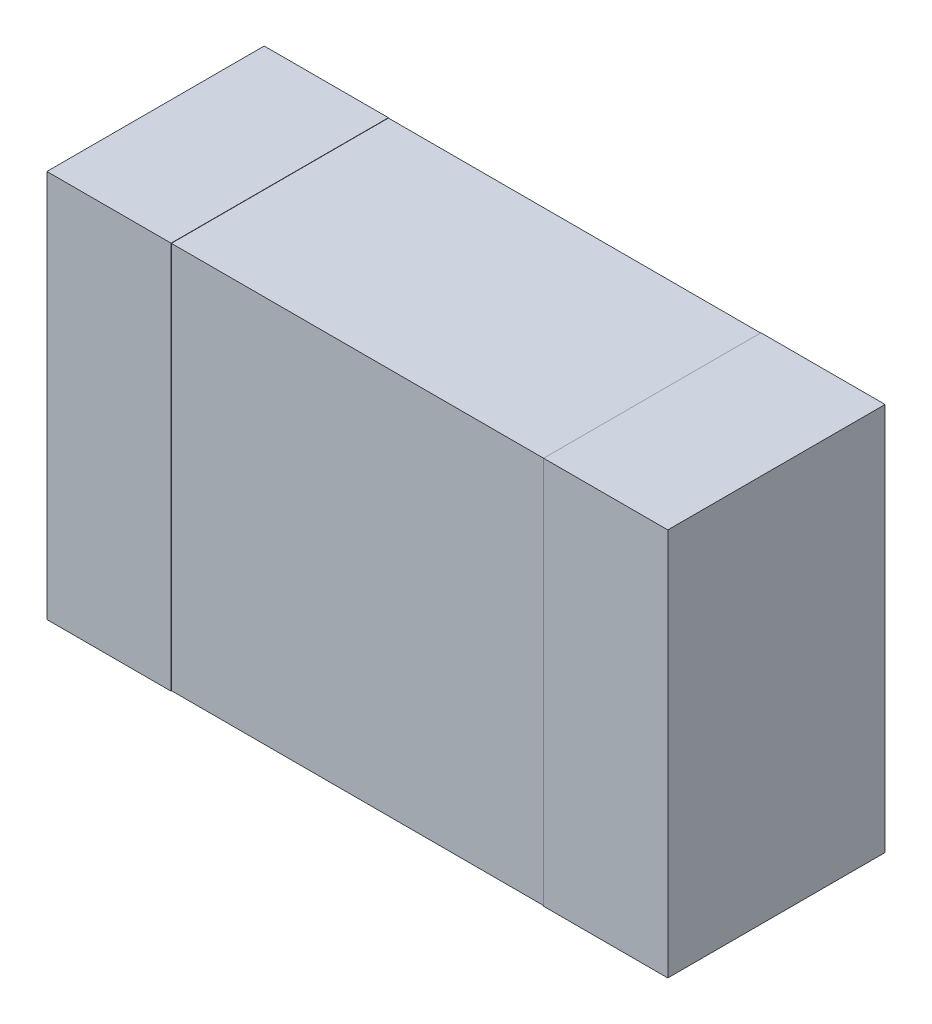
ISO-10303-21;
HEADER;
FILE_DESCRIPTION(('STEP AP214'),'2;1');
FILE_NAME('part.step','',(''),(''),'','','');
FILE_SCHEMA(('AUTOMOTIVE_DESIGN { 1 0 10303 214 1 1 1 1 }'));
ENDSEC;
DATA;
#1=APPLICATION_CONTEXT('core data for automotive mechanical design processes');
#2=APPLICATION_PROTOCOL_DEFINITION('international standard','automotive_design',2000,#1);
#3=PRODUCT_CONTEXT('',#1,'mechanical');
#4=PRODUCT('Part','Part','',(#3));
#5=PRODUCT_RELATED_PRODUCT_CATEGORY('part','',(#4));
#6=PRODUCT_DEFINITION_FORMATION('','',#4);
#7=PRODUCT_DEFINITION_CONTEXT('part definition',#1,'design');
#8=PRODUCT_DEFINITION('design','',#6,#7);
#9=PRODUCT_DEFINITION_SHAPE('','',#8);
#10=(LENGTH_UNIT() NAMED_UNIT(*) SI_UNIT(.MILLI.,.METRE.));
#11=(NAMED_UNIT(*) PLANE_ANGLE_UNIT() SI_UNIT($,.RADIAN.));
#12=(NAMED_UNIT(*) SI_UNIT($,.STERADIAN.) SOLID_ANGLE_UNIT());
#13=UNCERTAINTY_MEASURE_WITH_UNIT(LENGTH_MEASURE(1.E-05),#10,'distance_accuracy_value','');
#14=(GEOMETRIC_REPRESENTATION_CONTEXT(3) GLOBAL_UNCERTAINTY_ASSIGNED_CONTEXT((#13)) GLOBAL_UNIT_ASSIGNED_CONTEXT((#10,
#11,#12)) REPRESENTATION_CONTEXT('',''));
#15=CARTESIAN_POINT('',(0.,0.,0.));
#16=DIRECTION('',(0.,0.,1.));
#17=DIRECTION('',(1.,0.,0.));
#18=AXIS2_PLACEMENT_3D('',#15,#16,#17);
#19=CARTESIAN_POINT('',(0.6,-0.625,0.699));
#20=DIRECTION('',(0.,0.,-1.));
#21=DIRECTION('',(-1.,0.,0.));
#22=AXIS2_PLACEMENT_3D('',#19,#20,#21);
#23=PLANE('',#22);
#24=DIRECTION('',(0.,1.,0.));
#25=VECTOR('',#24,1.);
#26=CARTESIAN_POINT('',(0.6,-0.625,0.699));
#27=LINE('',#26,#25);
#28=CARTESIAN_POINT('',(0.6,-0.624,0.699));
#29=VERTEX_POINT('',#28);
#30=CARTESIAN_POINT('',(0.6,0.624,0.699));
#31=VERTEX_POINT('',#30);
#32=EDGE_CURVE('E147',#29,#31,#27,.T.);
#33=ORIENTED_EDGE('',*,*,#32,.T.);
#34=DIRECTION('',(-1.,0.,0.));
#35=VECTOR('',#34,1.);
#36=CARTESIAN_POINT('',(0.6,0.624,0.699));
#37=LINE('',#36,#35);
#38=CARTESIAN_POINT('',(-0.6,0.624,0.699));
#39=VERTEX_POINT('',#38);
#40=EDGE_CURVE('E171',#31,#39,#37,.T.);
#41=ORIENTED_EDGE('',*,*,#40,.T.);
#42=DIRECTION('',(0.,1.,0.));
#43=VECTOR('',#42,1.);
#44=CARTESIAN_POINT('',(-0.6,-0.625,0.699));
#45=LINE('',#44,#43);
#46=CARTESIAN_POINT('',(-0.6,-0.624,0.699));
#47=VERTEX_POINT('',#46);
#48=EDGE_CURVE('E203',#47,#39,#45,.T.);
#49=ORIENTED_EDGE('',*,*,#48,.F.);
#50=DIRECTION('',(-1.,0.,0.));
#51=VECTOR('',#50,1.);
#52=CARTESIAN_POINT('',(0.6,-0.624,0.699));
#53=LINE('',#52,#51);
#54=EDGE_CURVE('E11',#29,#47,#53,.T.);
#55=ORIENTED_EDGE('',*,*,#54,.F.);
#56=EDGE_LOOP('',(#33,#41,#49,#55));
#57=FACE_BOUND('',#56,.T.);
#58=ADVANCED_FACE('F16',(#57),#23,.F.);
#59=CARTESIAN_POINT('',(0.6,-0.624,0.7));
#60=DIRECTION('',(0.,1.,0.));
#61=DIRECTION('',(1.,0.,0.));
#62=AXIS2_PLACEMENT_3D('',#59,#60,#61);
#63=PLANE('',#62);
#64=DIRECTION('',(0.,0.,-1.));
#65=VECTOR('',#64,1.);
#66=CARTESIAN_POINT('',(0.6,-0.624,0.7));
#67=LINE('',#66,#65);
#68=CARTESIAN_POINT('',(0.6,-0.624,0.));
#69=VERTEX_POINT('',#68);
#70=EDGE_CURVE('E20',#29,#69,#67,.T.);
#71=ORIENTED_EDGE('',*,*,#70,.F.);
#72=ORIENTED_EDGE('',*,*,#54,.T.);
#73=DIRECTION('',(0.,0.,-1.));
#74=VECTOR('',#73,1.);
#75=CARTESIAN_POINT('',(-0.6,-0.624,0.7));
#76=LINE('',#75,#74);
#77=CARTESIAN_POINT('',(-0.6,-0.624,0.));
#78=VERTEX_POINT('',#77);
#79=EDGE_CURVE('E135',#47,#78,#76,.T.);
#80=ORIENTED_EDGE('',*,*,#79,.T.);
#81=DIRECTION('',(1.,0.,0.));
#82=VECTOR('',#81,1.);
#83=CARTESIAN_POINT('',(0.6,-0.624,0.));
#84=LINE('',#83,#82);
#85=EDGE_CURVE('E149',#78,#69,#84,.T.);
#86=ORIENTED_EDGE('',*,*,#85,.T.);
#87=EDGE_LOOP('',(#71,#72,#80,#86));
#88=FACE_BOUND('',#87,.T.);
#89=ADVANCED_FACE('F156',(#88),#63,.F.);
#90=CARTESIAN_POINT('',(0.6,0.625,0.7));
#91=DIRECTION('',(1.,0.,0.));
#92=DIRECTION('',(0.,1.,0.));
#93=AXIS2_PLACEMENT_3D('',#90,#91,#92);
#94=PLANE('',#93);
#95=DIRECTION('',(0.,-1.,0.));
#96=VECTOR('',#95,1.);
#97=CARTESIAN_POINT('',(0.6,0.625,0.));
#98=LINE('',#97,#96);
#99=CARTESIAN_POINT('',(0.6,0.625,0.));
#100=VERTEX_POINT('',#99);
#101=CARTESIAN_POINT('',(0.6,0.624,0.));
#102=VERTEX_POINT('',#101);
#103=EDGE_CURVE('E154',#100,#102,#98,.T.);
#104=ORIENTED_EDGE('',*,*,#103,.T.);
#105=DIRECTION('',(0.,0.,-1.));
#106=VECTOR('',#105,1.);
#107=CARTESIAN_POINT('',(0.6,0.624,0.7));
#108=LINE('',#107,#106);
#109=EDGE_CURVE('E177',#31,#102,#108,.T.);
#110=ORIENTED_EDGE('',*,*,#109,.F.);
#111=ORIENTED_EDGE('',*,*,#32,.F.);
#112=ORIENTED_EDGE('',*,*,#70,.T.);
#113=DIRECTION('',(0.,-1.,0.));
#114=VECTOR('',#113,1.);
#115=CARTESIAN_POINT('',(0.6,-0.624,0.));
#116=LINE('',#115,#114);
#117=CARTESIAN_POINT('',(0.6,-0.625,0.));
#118=VERTEX_POINT('',#117);
#119=EDGE_CURVE('E144',#69,#118,#116,.T.);
#120=ORIENTED_EDGE('',*,*,#119,.T.);
#121=DIRECTION('',(0.,0.,-1.));
#122=VECTOR('',#121,1.);
#123=CARTESIAN_POINT('',(0.6,-0.625,0.7));
#124=LINE('',#123,#122);
#125=CARTESIAN_POINT('',(0.6,-0.625,0.7));
#126=VERTEX_POINT('',#125);
#127=EDGE_CURVE('E173',#126,#118,#124,.T.);
#128=ORIENTED_EDGE('',*,*,#127,.F.);
#129=DIRECTION('',(0.,-1.,0.));
#130=VECTOR('',#129,1.);
#131=CARTESIAN_POINT('',(0.6,0.625,0.7));
#132=LINE('',#131,#130);
#133=CARTESIAN_POINT('',(0.6,0.625,0.7));
#134=VERTEX_POINT('',#133);
#135=EDGE_CURVE('E158',#134,#126,#132,.T.);
#136=ORIENTED_EDGE('',*,*,#135,.F.);
#137=DIRECTION('',(0.,0.,-1.));
#138=VECTOR('',#137,1.);
#139=CARTESIAN_POINT('',(0.6,0.625,0.7));
#140=LINE('',#139,#138);
#141=EDGE_CURVE('E194',#134,#100,#140,.T.);
#142=ORIENTED_EDGE('',*,*,#141,.T.);
#143=EDGE_LOOP('',(#104,#110,#111,#112,#120,#128,#136,#142));
#144=FACE_BOUND('',#143,.T.);
#145=ADVANCED_FACE('F142',(#144),#94,.F.);
#146=CARTESIAN_POINT('',(0.6,0.624,0.7));
#147=DIRECTION('',(0.,-1.,0.));
#148=DIRECTION('',(0.,0.,-1.));
#149=AXIS2_PLACEMENT_3D('',#146,#147,#148);
#150=PLANE('',#149);
#151=DIRECTION('',(0.,0.,-1.));
#152=VECTOR('',#151,1.);
#153=CARTESIAN_POINT('',(-0.6,0.624,0.7));
#154=LINE('',#153,#152);
#155=CARTESIAN_POINT('',(-0.6,0.624,0.));
#156=VERTEX_POINT('',#155);
#157=EDGE_CURVE('E216',#39,#156,#154,.T.);
#158=ORIENTED_EDGE('',*,*,#157,.F.);
#159=ORIENTED_EDGE('',*,*,#40,.F.);
#160=ORIENTED_EDGE('',*,*,#109,.T.);
#161=DIRECTION('',(-1.,0.,0.));
#162=VECTOR('',#161,1.);
#163=CARTESIAN_POINT('',(0.6,0.624,0.));
#164=LINE('',#163,#162);
#165=EDGE_CURVE('E186',#102,#156,#164,.T.);
#166=ORIENTED_EDGE('',*,*,#165,.T.);
#167=EDGE_LOOP('',(#158,#159,#160,#166));
#168=FACE_BOUND('',#167,.T.);
#169=ADVANCED_FACE('F297',(#168),#150,.F.);
#170=CARTESIAN_POINT('',(-0.6,0.625,0.7));
#171=DIRECTION('',(-1.,0.,0.));
#172=DIRECTION('',(0.,0.,1.));
#173=AXIS2_PLACEMENT_3D('',#170,#171,#172);
#174=PLANE('',#173);
#175=DIRECTION('',(0.,1.,0.));
#176=VECTOR('',#175,1.);
#177=CARTESIAN_POINT('',(-0.6,0.625,0.));
#178=LINE('',#177,#176);
#179=CARTESIAN_POINT('',(-0.6,0.625,0.));
#180=VERTEX_POINT('',#179);
#181=EDGE_CURVE('E165',#156,#180,#178,.T.);
#182=ORIENTED_EDGE('',*,*,#181,.T.);
#183=DIRECTION('',(0.,0.,-1.));
#184=VECTOR('',#183,1.);
#185=CARTESIAN_POINT('',(-0.6,0.625,0.7));
#186=LINE('',#185,#184);
#187=CARTESIAN_POINT('',(-0.6,0.625,0.7));
#188=VERTEX_POINT('',#187);
#189=EDGE_CURVE('E221',#188,#180,#186,.T.);
#190=ORIENTED_EDGE('',*,*,#189,.F.);
#191=DIRECTION('',(0.,1.,0.));
#192=VECTOR('',#191,1.);
#193=CARTESIAN_POINT('',(-0.6,0.625,0.7));
#194=LINE('',#193,#192);
#195=CARTESIAN_POINT('',(-0.6,-0.625,0.7));
#196=VERTEX_POINT('',#195);
#197=EDGE_CURVE('E180',#196,#188,#194,.T.);
#198=ORIENTED_EDGE('',*,*,#197,.F.);
#199=DIRECTION('',(0.,0.,-1.));
#200=VECTOR('',#199,1.);
#201=CARTESIAN_POINT('',(-0.6,-0.625,0.7));
#202=LINE('',#201,#200);
#203=CARTESIAN_POINT('',(-0.6,-0.625,0.));
#204=VERTEX_POINT('',#203);
#205=EDGE_CURVE('E234',#196,#204,#202,.T.);
#206=ORIENTED_EDGE('',*,*,#205,.T.);
#207=DIRECTION('',(0.,1.,0.));
#208=VECTOR('',#207,1.);
#209=CARTESIAN_POINT('',(-0.6,-0.624,0.));
#210=LINE('',#209,#208);
#211=EDGE_CURVE('E92',#204,#78,#210,.T.);
#212=ORIENTED_EDGE('',*,*,#211,.T.);
#213=ORIENTED_EDGE('',*,*,#79,.F.);
#214=ORIENTED_EDGE('',*,*,#48,.T.);
#215=ORIENTED_EDGE('',*,*,#157,.T.);
#216=EDGE_LOOP('',(#182,#190,#198,#206,#212,#213,#214,#215));
#217=FACE_BOUND('',#216,.T.);
#218=ADVANCED_FACE('F404',(#217),#174,.F.);
#219=CARTESIAN_POINT('',(0.,0.,0.));
#220=DIRECTION('',(0.,0.,1.));
#221=DIRECTION('',(1.,0.,0.));
#222=AXIS2_PLACEMENT_3D('',#219,#220,#221);
#223=PLANE('',#222);
#224=ORIENTED_EDGE('',*,*,#85,.F.);
#225=ORIENTED_EDGE('',*,*,#211,.F.);
#226=DIRECTION('',(1.,0.,0.));
#227=VECTOR('',#226,1.);
#228=CARTESIAN_POINT('',(-1.,-0.625,0.));
#229=LINE('',#228,#227);
#230=CARTESIAN_POINT('',(-1.,-0.625,0.));
#231=VERTEX_POINT('',#230);
#232=EDGE_CURVE('E242',#231,#204,#229,.T.);
#233=ORIENTED_EDGE('',*,*,#232,.F.);
#234=DIRECTION('',(0.,-1.,0.));
#235=VECTOR('',#234,1.);
#236=CARTESIAN_POINT('',(-1.,0.625,0.));
#237=LINE('',#236,#235);
#238=CARTESIAN_POINT('',(-1.,0.625,0.));
#239=VERTEX_POINT('',#238);
#240=EDGE_CURVE('E80',#239,#231,#237,.T.);
#241=ORIENTED_EDGE('',*,*,#240,.F.);
#242=DIRECTION('',(-1.,0.,0.));
#243=VECTOR('',#242,1.);
#244=CARTESIAN_POINT('',(-1.,0.625,0.));
#245=LINE('',#244,#243);
#246=EDGE_CURVE('E200',#180,#239,#245,.T.);
#247=ORIENTED_EDGE('',*,*,#246,.F.);
#248=ORIENTED_EDGE('',*,*,#181,.F.);
#249=ORIENTED_EDGE('',*,*,#165,.F.);
#250=ORIENTED_EDGE('',*,*,#103,.F.);
#251=DIRECTION('',(-1.,0.,0.));
#252=VECTOR('',#251,1.);
#253=CARTESIAN_POINT('',(-1.,0.625,0.));
#254=LINE('',#253,#252);
#255=CARTESIAN_POINT('',(1.,0.625,0.));
#256=VERTEX_POINT('',#255);
#257=EDGE_CURVE('E190',#256,#100,#254,.T.);
#258=ORIENTED_EDGE('',*,*,#257,.F.);
#259=DIRECTION('',(0.,1.,0.));
#260=VECTOR('',#259,1.);
#261=CARTESIAN_POINT('',(1.,0.625,0.));
#262=LINE('',#261,#260);
#263=CARTESIAN_POINT('',(1.,-0.625,0.));
#264=VERTEX_POINT('',#263);
#265=EDGE_CURVE('E199',#264,#256,#262,.T.);
#266=ORIENTED_EDGE('',*,*,#265,.F.);
#267=DIRECTION('',(1.,0.,0.));
#268=VECTOR('',#267,1.);
#269=CARTESIAN_POINT('',(-1.,-0.625,0.));
#270=LINE('',#269,#268);
#271=EDGE_CURVE('E151',#118,#264,#270,.T.);
#272=ORIENTED_EDGE('',*,*,#271,.F.);
#273=ORIENTED_EDGE('',*,*,#119,.F.);
#274=EDGE_LOOP('',(#224,#225,#233,#241,#247,#248,#249,#250,#258,#266,#272,#273));
#275=FACE_BOUND('',#274,.T.);
#276=ADVANCED_FACE('F18',(#275),#223,.F.);
#277=CARTESIAN_POINT('',(0.,0.,0.7));
#278=DIRECTION('',(0.,0.,1.));
#279=DIRECTION('',(1.,0.,0.));
#280=AXIS2_PLACEMENT_3D('',#277,#278,#279);
#281=PLANE('',#280);
#282=ORIENTED_EDGE('',*,*,#135,.T.);
#283=DIRECTION('',(1.,0.,0.));
#284=VECTOR('',#283,1.);
#285=CARTESIAN_POINT('',(-1.,-0.625,0.7));
#286=LINE('',#285,#284);
#287=CARTESIAN_POINT('',(1.,-0.625,0.7));
#288=VERTEX_POINT('',#287);
#289=EDGE_CURVE('E176',#126,#288,#286,.T.);
#290=ORIENTED_EDGE('',*,*,#289,.T.);
#291=DIRECTION('',(0.,1.,0.));
#292=VECTOR('',#291,1.);
#293=CARTESIAN_POINT('',(1.,0.625,0.7));
#294=LINE('',#293,#292);
#295=CARTESIAN_POINT('',(1.,0.625,0.7));
#296=VERTEX_POINT('',#295);
#297=EDGE_CURVE('E204',#288,#296,#294,.T.);
#298=ORIENTED_EDGE('',*,*,#297,.T.);
#299=DIRECTION('',(-1.,0.,0.));
#300=VECTOR('',#299,1.);
#301=CARTESIAN_POINT('',(-1.,0.625,0.7));
#302=LINE('',#301,#300);
#303=EDGE_CURVE('E212',#296,#134,#302,.T.);
#304=ORIENTED_EDGE('',*,*,#303,.T.);
#305=EDGE_LOOP('',(#282,#290,#298,#304));
#306=FACE_BOUND('',#305,.T.);
#307=ADVANCED_FACE('F267',(#306),#281,.T.);
#308=CARTESIAN_POINT('',(-1.,-0.625,0.7));
#309=DIRECTION('',(0.,1.,0.));
#310=DIRECTION('',(1.,0.,0.));
#311=AXIS2_PLACEMENT_3D('',#308,#309,#310);
#312=PLANE('',#311);
#313=ORIENTED_EDGE('',*,*,#289,.F.);
#314=ORIENTED_EDGE('',*,*,#127,.T.);
#315=ORIENTED_EDGE('',*,*,#271,.T.);
#316=DIRECTION('',(0.,0.,-1.));
#317=VECTOR('',#316,1.);
#318=CARTESIAN_POINT('',(1.,-0.625,0.7));
#319=LINE('',#318,#317);
#320=EDGE_CURVE('E195',#288,#264,#319,.T.);
#321=ORIENTED_EDGE('',*,*,#320,.F.);
#322=EDGE_LOOP('',(#313,#314,#315,#321));
#323=FACE_BOUND('',#322,.T.);
#324=ADVANCED_FACE('F271',(#323),#312,.F.);
#325=CARTESIAN_POINT('',(-1.,0.625,0.7));
#326=DIRECTION('',(1.,0.,0.));
#327=DIRECTION('',(0.,1.,0.));
#328=AXIS2_PLACEMENT_3D('',#325,#326,#327);
#329=PLANE('',#328);
#330=ORIENTED_EDGE('',*,*,#240,.T.);
#331=DIRECTION('',(0.,0.,-1.));
#332=VECTOR('',#331,1.);
#333=CARTESIAN_POINT('',(-1.,-0.625,0.7));
#334=LINE('',#333,#332);
#335=CARTESIAN_POINT('',(-1.,-0.625,0.7));
#336=VERTEX_POINT('',#335);
#337=EDGE_CURVE('E224',#336,#231,#334,.T.);
#338=ORIENTED_EDGE('',*,*,#337,.F.);
#339=DIRECTION('',(0.,-1.,0.));
#340=VECTOR('',#339,1.);
#341=CARTESIAN_POINT('',(-1.,0.625,0.7));
#342=LINE('',#341,#340);
#343=CARTESIAN_POINT('',(-1.,0.625,0.7));
#344=VERTEX_POINT('',#343);
#345=EDGE_CURVE('E249',#344,#336,#342,.T.);
#346=ORIENTED_EDGE('',*,*,#345,.F.);
#347=DIRECTION('',(0.,0.,-1.));
#348=VECTOR('',#347,1.);
#349=CARTESIAN_POINT('',(-1.,0.625,0.7));
#350=LINE('',#349,#348);
#351=EDGE_CURVE('E196',#344,#239,#350,.T.);
#352=ORIENTED_EDGE('',*,*,#351,.T.);
#353=EDGE_LOOP('',(#330,#338,#346,#352));
#354=FACE_BOUND('',#353,.T.);
#355=ADVANCED_FACE('F446',(#354),#329,.F.);
#356=CARTESIAN_POINT('',(-1.,0.625,0.7));
#357=DIRECTION('',(0.,-1.,0.));
#358=DIRECTION('',(0.,0.,-1.));
#359=AXIS2_PLACEMENT_3D('',#356,#357,#358);
#360=PLANE('',#359);
#361=ORIENTED_EDGE('',*,*,#257,.T.);
#362=ORIENTED_EDGE('',*,*,#141,.F.);
#363=ORIENTED_EDGE('',*,*,#303,.F.);
#364=DIRECTION('',(0.,0.,-1.));
#365=VECTOR('',#364,1.);
#366=CARTESIAN_POINT('',(1.,0.625,0.7));
#367=LINE('',#366,#365);
#368=EDGE_CURVE('E208',#296,#256,#367,.T.);
#369=ORIENTED_EDGE('',*,*,#368,.T.);
#370=EDGE_LOOP('',(#361,#362,#363,#369));
#371=FACE_BOUND('',#370,.T.);
#372=ADVANCED_FACE('F425',(#371),#360,.F.);
#373=CARTESIAN_POINT('',(1.,0.625,0.7));
#374=DIRECTION('',(-1.,0.,0.));
#375=DIRECTION('',(0.,0.,1.));
#376=AXIS2_PLACEMENT_3D('',#373,#374,#375);
#377=PLANE('',#376);
#378=ORIENTED_EDGE('',*,*,#265,.T.);
#379=ORIENTED_EDGE('',*,*,#368,.F.);
#380=ORIENTED_EDGE('',*,*,#297,.F.);
#381=ORIENTED_EDGE('',*,*,#320,.T.);
#382=EDGE_LOOP('',(#378,#379,#380,#381));
#383=FACE_BOUND('',#382,.T.);
#384=ADVANCED_FACE('F274',(#383),#377,.F.);
#385=CARTESIAN_POINT('',(-1.,0.625,0.7));
#386=DIRECTION('',(0.,-1.,0.));
#387=DIRECTION('',(0.,0.,-1.));
#388=AXIS2_PLACEMENT_3D('',#385,#386,#387);
#389=PLANE('',#388);
#390=DIRECTION('',(-1.,0.,0.));
#391=VECTOR('',#390,1.);
#392=CARTESIAN_POINT('',(-1.,0.625,0.7));
#393=LINE('',#392,#391);
#394=EDGE_CURVE('E184',#188,#344,#393,.T.);
#395=ORIENTED_EDGE('',*,*,#394,.F.);
#396=ORIENTED_EDGE('',*,*,#189,.T.);
#397=ORIENTED_EDGE('',*,*,#246,.T.);
#398=ORIENTED_EDGE('',*,*,#351,.F.);
#399=EDGE_LOOP('',(#395,#396,#397,#398));
#400=FACE_BOUND('',#399,.T.);
#401=ADVANCED_FACE('F424',(#400),#389,.F.);
#402=CARTESIAN_POINT('',(-1.,-0.625,0.7));
#403=DIRECTION('',(0.,1.,0.));
#404=DIRECTION('',(1.,0.,0.));
#405=AXIS2_PLACEMENT_3D('',#402,#403,#404);
#406=PLANE('',#405);
#407=ORIENTED_EDGE('',*,*,#232,.T.);
#408=ORIENTED_EDGE('',*,*,#205,.F.);
#409=DIRECTION('',(1.,0.,0.));
#410=VECTOR('',#409,1.);
#411=CARTESIAN_POINT('',(-1.,-0.625,0.7));
#412=LINE('',#411,#410);
#413=EDGE_CURVE('E185',#336,#196,#412,.T.);
#414=ORIENTED_EDGE('',*,*,#413,.F.);
#415=ORIENTED_EDGE('',*,*,#337,.T.);
#416=EDGE_LOOP('',(#407,#408,#414,#415));
#417=FACE_BOUND('',#416,.T.);
#418=ADVANCED_FACE('F487',(#417),#406,.F.);
#419=CARTESIAN_POINT('',(0.,0.,0.7));
#420=DIRECTION('',(0.,0.,1.));
#421=DIRECTION('',(1.,0.,0.));
#422=AXIS2_PLACEMENT_3D('',#419,#420,#421);
#423=PLANE('',#422);
#424=ORIENTED_EDGE('',*,*,#413,.T.);
#425=ORIENTED_EDGE('',*,*,#197,.T.);
#426=ORIENTED_EDGE('',*,*,#394,.T.);
#427=ORIENTED_EDGE('',*,*,#345,.T.);
#428=EDGE_LOOP('',(#424,#425,#426,#427));
#429=FACE_BOUND('',#428,.T.);
#430=ADVANCED_FACE('F482',(#429),#423,.T.);
#431=CLOSED_SHELL('',(#58,#89,#145,#169,#218,#276,#307,#324,#355,#372,#384,#401,#418,#430));
#432=MANIFOLD_SOLID_BREP('B1',#431);
#433=ADVANCED_BREP_SHAPE_REPRESENTATION('',(#18,#432),#14);
#434=SHAPE_DEFINITION_REPRESENTATION(#9,#433);
ENDSEC;
END-ISO-10303-21;
